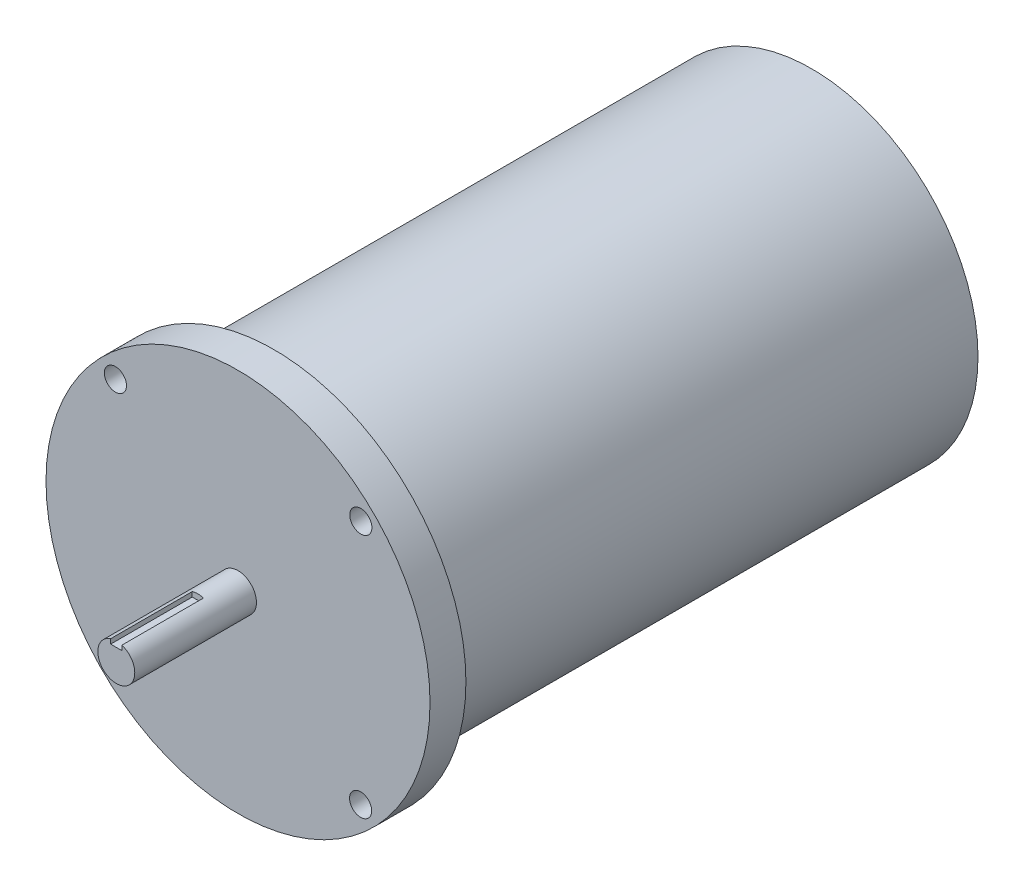
ISO-10303-21;
HEADER;
FILE_DESCRIPTION(('STEP AP214'),'2;1');
FILE_NAME('part.step','',(''),(''),'','','');
FILE_SCHEMA(('AUTOMOTIVE_DESIGN { 1 0 10303 214 1 1 1 1 }'));
ENDSEC;
DATA;
#1=APPLICATION_CONTEXT('core data for automotive mechanical design processes');
#2=APPLICATION_PROTOCOL_DEFINITION('international standard','automotive_design',2000,#1);
#3=PRODUCT_CONTEXT('',#1,'mechanical');
#4=PRODUCT('Part','Part','',(#3));
#5=PRODUCT_RELATED_PRODUCT_CATEGORY('part','',(#4));
#6=PRODUCT_DEFINITION_FORMATION('','',#4);
#7=PRODUCT_DEFINITION_CONTEXT('part definition',#1,'design');
#8=PRODUCT_DEFINITION('design','',#6,#7);
#9=PRODUCT_DEFINITION_SHAPE('','',#8);
#10=(LENGTH_UNIT() NAMED_UNIT(*) SI_UNIT(.MILLI.,.METRE.));
#11=(NAMED_UNIT(*) PLANE_ANGLE_UNIT() SI_UNIT($,.RADIAN.));
#12=(NAMED_UNIT(*) SI_UNIT($,.STERADIAN.) SOLID_ANGLE_UNIT());
#13=UNCERTAINTY_MEASURE_WITH_UNIT(LENGTH_MEASURE(1.E-05),#10,'distance_accuracy_value','');
#14=(GEOMETRIC_REPRESENTATION_CONTEXT(3) GLOBAL_UNCERTAINTY_ASSIGNED_CONTEXT((#13)) GLOBAL_UNIT_ASSIGNED_CONTEXT((#10,
#11,#12)) REPRESENTATION_CONTEXT('',''));
#15=CARTESIAN_POINT('',(0.,0.,0.));
#16=DIRECTION('',(0.,0.,1.));
#17=DIRECTION('',(1.,0.,0.));
#18=AXIS2_PLACEMENT_3D('',#15,#16,#17);
#19=CARTESIAN_POINT('',(0.,0.,231.199972222194));
#20=DIRECTION('',(0.,0.,1.));
#21=DIRECTION('',(1.,0.,0.));
#22=AXIS2_PLACEMENT_3D('',#19,#20,#21);
#23=PLANE('',#22);
#24=CARTESIAN_POINT('',(0.,0.,231.199972222194));
#25=DIRECTION('',(0.,0.,1.));
#26=DIRECTION('',(1.,0.,0.));
#27=AXIS2_PLACEMENT_3D('',#24,#25,#26);
#28=CIRCLE('',#27,71.501);
#29=CARTESIAN_POINT('',(-47.9570839676895,53.0331132248144,231.199972222194));
#30=VERTEX_POINT('',#29);
#31=CARTESIAN_POINT('',(-52.9513725196273,48.0473219783128,231.199972222194));
#32=VERTEX_POINT('',#31);
#33=EDGE_CURVE('E196',#30,#32,#28,.T.);
#34=ORIENTED_EDGE('',*,*,#33,.T.);
#35=CARTESIAN_POINT('',(-52.7140651842166,52.803905991926,231.199972222194));
#36=DIRECTION('',(0.,0.,1.));
#37=DIRECTION('',(1.,0.,0.));
#38=AXIS2_PLACEMENT_3D('',#35,#36,#37);
#39=CIRCLE('',#38,4.7625);
#40=EDGE_CURVE('E165',#32,#30,#39,.T.);
#41=ORIENTED_EDGE('',*,*,#40,.T.);
#42=EDGE_LOOP('',(#34,#41));
#43=FACE_BOUND('',#42,.T.);
#44=ADVANCED_FACE('F38',(#43),#23,.T.);
#45=CARTESIAN_POINT('',(53.0331132248144,47.9570839676896,231.199972222194));
#46=VERTEX_POINT('',#45);
#47=CARTESIAN_POINT('',(48.0473219783069,52.9513725196327,231.199972222194));
#48=VERTEX_POINT('',#47);
#49=EDGE_CURVE('E172',#46,#48,#28,.T.);
#50=ORIENTED_EDGE('',*,*,#49,.T.);
#51=CARTESIAN_POINT('',(52.803905991926,52.7140651842226,231.199972222194));
#52=DIRECTION('',(0.,0.,1.));
#53=DIRECTION('',(1.,0.,0.));
#54=AXIS2_PLACEMENT_3D('',#51,#52,#53);
#55=CIRCLE('',#54,4.76250000000591);
#56=EDGE_CURVE('E156',#48,#46,#55,.T.);
#57=ORIENTED_EDGE('',*,*,#56,.T.);
#58=EDGE_LOOP('',(#50,#57));
#59=FACE_BOUND('',#58,.T.);
#60=ADVANCED_FACE('F211',(#59),#23,.T.);
#61=CARTESIAN_POINT('',(47.9570839676879,-53.0331132248158,231.199972222194));
#62=VERTEX_POINT('',#61);
#63=CARTESIAN_POINT('',(52.9513725196396,-48.0473219782993,231.199972222194));
#64=VERTEX_POINT('',#63);
#65=EDGE_CURVE('E197',#62,#64,#28,.T.);
#66=ORIENTED_EDGE('',*,*,#65,.T.);
#67=CARTESIAN_POINT('',(52.7140651842226,-52.8039059919201,231.199972222194));
#68=DIRECTION('',(0.,0.,1.));
#69=DIRECTION('',(1.,0.,0.));
#70=AXIS2_PLACEMENT_3D('',#67,#68,#69);
#71=CIRCLE('',#70,4.76250000000791);
#72=EDGE_CURVE('E149',#64,#62,#71,.T.);
#73=ORIENTED_EDGE('',*,*,#72,.T.);
#74=EDGE_LOOP('',(#66,#73));
#75=FACE_BOUND('',#74,.T.);
#76=ADVANCED_FACE('F218',(#75),#23,.T.);
#77=CARTESIAN_POINT('',(-53.0331132248162,-47.9570839676874,231.199972222194));
#78=VERTEX_POINT('',#77);
#79=CARTESIAN_POINT('',(-48.0473219783048,-52.9513725196346,231.199972222194));
#80=VERTEX_POINT('',#79);
#81=EDGE_CURVE('E187',#78,#80,#28,.T.);
#82=ORIENTED_EDGE('',*,*,#81,.T.);
#83=CARTESIAN_POINT('',(-52.80390599192,-52.7140651842167,231.199972222194));
#84=DIRECTION('',(0.,0.,1.));
#85=DIRECTION('',(1.,0.,0.));
#86=AXIS2_PLACEMENT_3D('',#83,#84,#85);
#87=CIRCLE('',#86,4.76250000000245);
#88=EDGE_CURVE('E144',#80,#78,#87,.T.);
#89=ORIENTED_EDGE('',*,*,#88,.T.);
#90=EDGE_LOOP('',(#82,#89));
#91=FACE_BOUND('',#90,.T.);
#92=ADVANCED_FACE('F186',(#91),#23,.T.);
#93=CARTESIAN_POINT('',(0.,0.,231.199972222194));
#94=DIRECTION('',(0.,0.,-1.));
#95=DIRECTION('',(-1.,0.,0.));
#96=AXIS2_PLACEMENT_3D('',#93,#94,#95);
#97=CYLINDRICAL_SURFACE('',#96,71.501);
#98=ORIENTED_EDGE('',*,*,#49,.F.);
#99=EDGE_CURVE('E176',#64,#46,#28,.T.);
#100=ORIENTED_EDGE('',*,*,#99,.F.);
#101=ORIENTED_EDGE('',*,*,#65,.F.);
#102=EDGE_CURVE('E195',#80,#62,#28,.T.);
#103=ORIENTED_EDGE('',*,*,#102,.F.);
#104=ORIENTED_EDGE('',*,*,#81,.F.);
#105=EDGE_CURVE('E193',#32,#78,#28,.T.);
#106=ORIENTED_EDGE('',*,*,#105,.F.);
#107=ORIENTED_EDGE('',*,*,#33,.F.);
#108=EDGE_CURVE('E175',#48,#30,#28,.T.);
#109=ORIENTED_EDGE('',*,*,#108,.F.);
#110=EDGE_LOOP('',(#98,#100,#101,#103,#104,#106,#107,#109));
#111=FACE_BOUND('',#110,.T.);
#112=CARTESIAN_POINT('',(0.,0.,0.));
#113=DIRECTION('',(0.,0.,1.));
#114=DIRECTION('',(1.,0.,0.));
#115=AXIS2_PLACEMENT_3D('',#112,#113,#114);
#116=CIRCLE('',#115,71.501);
#117=CARTESIAN_POINT('',(71.501,0.,0.));
#118=VERTEX_POINT('',#117);
#119=EDGE_CURVE('E169',#118,#118,#116,.T.);
#120=ORIENTED_EDGE('',*,*,#119,.T.);
#121=EDGE_LOOP('',(#120));
#122=FACE_BOUND('',#121,.T.);
#123=ADVANCED_FACE('F40',(#111,#122),#97,.T.);
#124=CARTESIAN_POINT('',(0.,0.,0.));
#125=DIRECTION('',(0.,0.,1.));
#126=DIRECTION('',(1.,0.,0.));
#127=AXIS2_PLACEMENT_3D('',#124,#125,#126);
#128=PLANE('',#127);
#129=ORIENTED_EDGE('',*,*,#119,.F.);
#130=EDGE_LOOP('',(#129));
#131=FACE_BOUND('',#130,.T.);
#132=ADVANCED_FACE('F225',(#131),#128,.F.);
#133=CARTESIAN_POINT('',(0.,0.,231.199972222194));
#134=DIRECTION('',(0.,0.,1.));
#135=DIRECTION('',(1.,0.,0.));
#136=AXIS2_PLACEMENT_3D('',#133,#134,#135);
#137=PLANE('',#136);
#138=CARTESIAN_POINT('',(0.,0.,231.199972222194));
#139=DIRECTION('',(0.,0.,1.));
#140=DIRECTION('',(1.,0.,0.));
#141=AXIS2_PLACEMENT_3D('',#138,#139,#140);
#142=CIRCLE('',#141,82.55);
#143=CARTESIAN_POINT('',(82.55,0.,231.199972222194));
#144=VERTEX_POINT('',#143);
#145=EDGE_CURVE('E162',#144,#144,#142,.T.);
#146=ORIENTED_EDGE('',*,*,#145,.F.);
#147=EDGE_LOOP('',(#146));
#148=FACE_BOUND('',#147,.T.);
#149=EDGE_CURVE('E148',#46,#48,#55,.T.);
#150=ORIENTED_EDGE('',*,*,#149,.T.);
#151=ORIENTED_EDGE('',*,*,#108,.T.);
#152=EDGE_CURVE('E155',#30,#32,#39,.T.);
#153=ORIENTED_EDGE('',*,*,#152,.T.);
#154=ORIENTED_EDGE('',*,*,#105,.T.);
#155=EDGE_CURVE('E60',#78,#80,#87,.T.);
#156=ORIENTED_EDGE('',*,*,#155,.T.);
#157=ORIENTED_EDGE('',*,*,#102,.T.);
#158=EDGE_CURVE('E142',#62,#64,#71,.T.);
#159=ORIENTED_EDGE('',*,*,#158,.T.);
#160=ORIENTED_EDGE('',*,*,#99,.T.);
#161=EDGE_LOOP('',(#150,#151,#153,#154,#156,#157,#159,#160));
#162=FACE_BOUND('',#161,.T.);
#163=ADVANCED_FACE('F204',(#148,#162),#137,.F.);
#164=CARTESIAN_POINT('',(0.,0.,246.633999999972));
#165=DIRECTION('',(0.,0.,1.));
#166=DIRECTION('',(1.,0.,0.));
#167=AXIS2_PLACEMENT_3D('',#164,#165,#166);
#168=PLANE('',#167);
#169=CARTESIAN_POINT('',(0.,0.,246.633999999972));
#170=DIRECTION('',(0.,0.,1.));
#171=DIRECTION('',(1.,0.,0.));
#172=AXIS2_PLACEMENT_3D('',#169,#170,#171);
#173=CIRCLE('',#172,7.9375);
#174=CARTESIAN_POINT('',(7.9375,0.,246.633999999972));
#175=VERTEX_POINT('',#174);
#176=EDGE_CURVE('E133',#175,#175,#173,.T.);
#177=ORIENTED_EDGE('',*,*,#176,.F.);
#178=EDGE_LOOP('',(#177));
#179=FACE_BOUND('',#178,.T.);
#180=CARTESIAN_POINT('',(52.7140651842226,-52.8039059919201,246.633999999972));
#181=DIRECTION('',(0.,0.,1.));
#182=DIRECTION('',(1.,0.,0.));
#183=AXIS2_PLACEMENT_3D('',#180,#181,#182);
#184=CIRCLE('',#183,4.76250000000791);
#185=CARTESIAN_POINT('',(57.4765651842305,-52.8039059919201,246.633999999972));
#186=VERTEX_POINT('',#185);
#187=EDGE_CURVE('E145',#186,#186,#184,.T.);
#188=ORIENTED_EDGE('',*,*,#187,.F.);
#189=EDGE_LOOP('',(#188));
#190=FACE_BOUND('',#189,.T.);
#191=CARTESIAN_POINT('',(-52.7140651842166,52.803905991926,246.633999999972));
#192=DIRECTION('',(0.,0.,1.));
#193=DIRECTION('',(1.,0.,0.));
#194=AXIS2_PLACEMENT_3D('',#191,#192,#193);
#195=CIRCLE('',#194,4.7625);
#196=CARTESIAN_POINT('',(-47.9515651842166,52.803905991926,246.633999999972));
#197=VERTEX_POINT('',#196);
#198=EDGE_CURVE('E159',#197,#197,#195,.T.);
#199=ORIENTED_EDGE('',*,*,#198,.F.);
#200=EDGE_LOOP('',(#199));
#201=FACE_BOUND('',#200,.T.);
#202=CARTESIAN_POINT('',(0.,0.,246.633999999972));
#203=DIRECTION('',(0.,0.,1.));
#204=DIRECTION('',(1.,0.,0.));
#205=AXIS2_PLACEMENT_3D('',#202,#203,#204);
#206=CIRCLE('',#205,82.55);
#207=CARTESIAN_POINT('',(82.55,0.,246.633999999972));
#208=VERTEX_POINT('',#207);
#209=EDGE_CURVE('E166',#208,#208,#206,.T.);
#210=ORIENTED_EDGE('',*,*,#209,.T.);
#211=EDGE_LOOP('',(#210));
#212=FACE_BOUND('',#211,.T.);
#213=CARTESIAN_POINT('',(52.803905991926,52.7140651842226,246.633999999972));
#214=DIRECTION('',(0.,0.,1.));
#215=DIRECTION('',(1.,0.,0.));
#216=AXIS2_PLACEMENT_3D('',#213,#214,#215);
#217=CIRCLE('',#216,4.76250000000591);
#218=CARTESIAN_POINT('',(57.5664059919319,52.7140651842226,246.633999999972));
#219=VERTEX_POINT('',#218);
#220=EDGE_CURVE('E152',#219,#219,#217,.T.);
#221=ORIENTED_EDGE('',*,*,#220,.F.);
#222=EDGE_LOOP('',(#221));
#223=FACE_BOUND('',#222,.T.);
#224=CARTESIAN_POINT('',(-52.80390599192,-52.7140651842167,246.633999999972));
#225=DIRECTION('',(0.,0.,1.));
#226=DIRECTION('',(1.,0.,0.));
#227=AXIS2_PLACEMENT_3D('',#224,#225,#226);
#228=CIRCLE('',#227,4.76250000000245);
#229=CARTESIAN_POINT('',(-48.0414059919176,-52.7140651842167,246.633999999972));
#230=VERTEX_POINT('',#229);
#231=EDGE_CURVE('E139',#230,#230,#228,.T.);
#232=ORIENTED_EDGE('',*,*,#231,.F.);
#233=EDGE_LOOP('',(#232));
#234=FACE_BOUND('',#233,.T.);
#235=ADVANCED_FACE('F257',(#179,#190,#201,#212,#223,#234),#168,.T.);
#236=CARTESIAN_POINT('',(0.,0.,246.633999999972));
#237=DIRECTION('',(0.,0.,-1.));
#238=DIRECTION('',(-1.,0.,0.));
#239=AXIS2_PLACEMENT_3D('',#236,#237,#238);
#240=CYLINDRICAL_SURFACE('',#239,82.55);
#241=ORIENTED_EDGE('',*,*,#209,.F.);
#242=EDGE_LOOP('',(#241));
#243=FACE_BOUND('',#242,.T.);
#244=ORIENTED_EDGE('',*,*,#145,.T.);
#245=EDGE_LOOP('',(#244));
#246=FACE_BOUND('',#245,.T.);
#247=ADVANCED_FACE('F265',(#243,#246),#240,.T.);
#248=CARTESIAN_POINT('',(-52.7140651842166,52.803905991926,246.633999999972));
#249=DIRECTION('',(0.,0.,-1.));
#250=DIRECTION('',(-1.,0.,0.));
#251=AXIS2_PLACEMENT_3D('',#248,#249,#250);
#252=CYLINDRICAL_SURFACE('',#251,4.7625);
#253=ORIENTED_EDGE('',*,*,#198,.T.);
#254=EDGE_LOOP('',(#253));
#255=FACE_BOUND('',#254,.T.);
#256=ORIENTED_EDGE('',*,*,#152,.F.);
#257=ORIENTED_EDGE('',*,*,#40,.F.);
#258=EDGE_LOOP('',(#256,#257));
#259=FACE_BOUND('',#258,.T.);
#260=ADVANCED_FACE('F274',(#255,#259),#252,.F.);
#261=CARTESIAN_POINT('',(52.803905991926,52.7140651842226,246.633999999972));
#262=DIRECTION('',(0.,0.,-1.));
#263=DIRECTION('',(-1.,0.,0.));
#264=AXIS2_PLACEMENT_3D('',#261,#262,#263);
#265=CYLINDRICAL_SURFACE('',#264,4.76250000000591);
#266=ORIENTED_EDGE('',*,*,#220,.T.);
#267=EDGE_LOOP('',(#266));
#268=FACE_BOUND('',#267,.T.);
#269=ORIENTED_EDGE('',*,*,#56,.F.);
#270=ORIENTED_EDGE('',*,*,#149,.F.);
#271=EDGE_LOOP('',(#269,#270));
#272=FACE_BOUND('',#271,.T.);
#273=ADVANCED_FACE('F208',(#268,#272),#265,.F.);
#274=CARTESIAN_POINT('',(52.7140651842226,-52.8039059919201,246.633999999972));
#275=DIRECTION('',(0.,0.,-1.));
#276=DIRECTION('',(-1.,0.,0.));
#277=AXIS2_PLACEMENT_3D('',#274,#275,#276);
#278=CYLINDRICAL_SURFACE('',#277,4.76250000000791);
#279=ORIENTED_EDGE('',*,*,#187,.T.);
#280=EDGE_LOOP('',(#279));
#281=FACE_BOUND('',#280,.T.);
#282=ORIENTED_EDGE('',*,*,#72,.F.);
#283=ORIENTED_EDGE('',*,*,#158,.F.);
#284=EDGE_LOOP('',(#282,#283));
#285=FACE_BOUND('',#284,.T.);
#286=ADVANCED_FACE('F288',(#281,#285),#278,.F.);
#287=CARTESIAN_POINT('',(-52.80390599192,-52.7140651842167,246.633999999972));
#288=DIRECTION('',(0.,0.,-1.));
#289=DIRECTION('',(-1.,0.,0.));
#290=AXIS2_PLACEMENT_3D('',#287,#288,#289);
#291=CYLINDRICAL_SURFACE('',#290,4.76250000000245);
#292=ORIENTED_EDGE('',*,*,#231,.T.);
#293=EDGE_LOOP('',(#292));
#294=FACE_BOUND('',#293,.T.);
#295=ORIENTED_EDGE('',*,*,#155,.F.);
#296=ORIENTED_EDGE('',*,*,#88,.F.);
#297=EDGE_LOOP('',(#295,#296));
#298=FACE_BOUND('',#297,.T.);
#299=ADVANCED_FACE('F296',(#294,#298),#291,.F.);
#300=CARTESIAN_POINT('',(0.,0.,298.957999999972));
#301=DIRECTION('',(0.,0.,-1.));
#302=DIRECTION('',(-1.,0.,0.));
#303=AXIS2_PLACEMENT_3D('',#300,#301,#302);
#304=CYLINDRICAL_SURFACE('',#303,7.9375);
#305=CARTESIAN_POINT('',(0.,0.,263.905999999972));
#306=DIRECTION('',(0.,0.,1.));
#307=DIRECTION('',(1.,0.,0.));
#308=AXIS2_PLACEMENT_3D('',#305,#306,#307);
#309=CIRCLE('',#308,7.9375);
#310=CARTESIAN_POINT('',(2.413,7.56183425168788,263.905999999972));
#311=VERTEX_POINT('',#310);
#312=CARTESIAN_POINT('',(-2.413,7.56183425168788,263.905999999972));
#313=VERTEX_POINT('',#312);
#314=EDGE_CURVE('E11',#311,#313,#309,.T.);
#315=ORIENTED_EDGE('',*,*,#314,.F.);
#316=DIRECTION('',(0.,0.,-1.));
#317=VECTOR('',#316,1.);
#318=CARTESIAN_POINT('',(2.413,7.56183425168788,298.957999999972));
#319=LINE('',#318,#317);
#320=CARTESIAN_POINT('',(2.413,7.56183425168788,298.957999999972));
#321=VERTEX_POINT('',#320);
#322=EDGE_CURVE('E130',#311,#321,#319,.F.);
#323=ORIENTED_EDGE('',*,*,#322,.T.);
#324=CARTESIAN_POINT('',(0.,0.,298.957999999972));
#325=DIRECTION('',(0.,0.,1.));
#326=DIRECTION('',(1.,0.,0.));
#327=AXIS2_PLACEMENT_3D('',#324,#325,#326);
#328=CIRCLE('',#327,7.9375);
#329=CARTESIAN_POINT('',(-2.413,7.56183425168788,298.957999999972));
#330=VERTEX_POINT('',#329);
#331=EDGE_CURVE('E134',#330,#321,#328,.T.);
#332=ORIENTED_EDGE('',*,*,#331,.F.);
#333=DIRECTION('',(0.,0.,-1.));
#334=VECTOR('',#333,1.);
#335=CARTESIAN_POINT('',(-2.413,7.56183425168788,298.957999999972));
#336=LINE('',#335,#334);
#337=EDGE_CURVE('E53',#330,#313,#336,.T.);
#338=ORIENTED_EDGE('',*,*,#337,.T.);
#339=EDGE_LOOP('',(#315,#323,#332,#338));
#340=FACE_BOUND('',#339,.T.);
#341=ORIENTED_EDGE('',*,*,#176,.T.);
#342=EDGE_LOOP('',(#341));
#343=FACE_BOUND('',#342,.T.);
#344=ADVANCED_FACE('F303',(#340,#343),#304,.T.);
#345=CARTESIAN_POINT('',(0.,0.,298.957999999972));
#346=DIRECTION('',(0.,0.,1.));
#347=DIRECTION('',(1.,0.,0.));
#348=AXIS2_PLACEMENT_3D('',#345,#346,#347);
#349=PLANE('',#348);
#350=DIRECTION('',(0.,1.,0.));
#351=VECTOR('',#350,1.);
#352=CARTESIAN_POINT('',(2.413,10.3505,298.957999999972));
#353=LINE('',#352,#351);
#354=CARTESIAN_POINT('',(2.413,5.5245,298.957999999972));
#355=VERTEX_POINT('',#354);
#356=EDGE_CURVE('E124',#355,#321,#353,.T.);
#357=ORIENTED_EDGE('',*,*,#356,.F.);
#358=DIRECTION('',(1.,0.,0.));
#359=VECTOR('',#358,1.);
#360=CARTESIAN_POINT('',(-2.413,5.5245,298.957999999972));
#361=LINE('',#360,#359);
#362=CARTESIAN_POINT('',(-2.413,5.5245,298.957999999972));
#363=VERTEX_POINT('',#362);
#364=EDGE_CURVE('E126',#363,#355,#361,.T.);
#365=ORIENTED_EDGE('',*,*,#364,.F.);
#366=DIRECTION('',(0.,-1.,0.));
#367=VECTOR('',#366,1.);
#368=CARTESIAN_POINT('',(-2.413,0.,298.957999999972));
#369=LINE('',#368,#367);
#370=EDGE_CURVE('E46',#330,#363,#369,.T.);
#371=ORIENTED_EDGE('',*,*,#370,.F.);
#372=ORIENTED_EDGE('',*,*,#331,.T.);
#373=EDGE_LOOP('',(#357,#365,#371,#372));
#374=FACE_BOUND('',#373,.T.);
#375=ADVANCED_FACE('F310',(#374),#349,.T.);
#376=CARTESIAN_POINT('',(0.,0.,263.905999999972));
#377=DIRECTION('',(0.,0.,1.));
#378=DIRECTION('',(1.,0.,0.));
#379=AXIS2_PLACEMENT_3D('',#376,#377,#378);
#380=PLANE('',#379);
#381=ORIENTED_EDGE('',*,*,#314,.T.);
#382=DIRECTION('',(0.,-1.,0.));
#383=VECTOR('',#382,1.);
#384=CARTESIAN_POINT('',(-2.413,10.3505,263.905999999972));
#385=LINE('',#384,#383);
#386=CARTESIAN_POINT('',(-2.413,5.5245,263.905999999972));
#387=VERTEX_POINT('',#386);
#388=EDGE_CURVE('E102',#313,#387,#385,.T.);
#389=ORIENTED_EDGE('',*,*,#388,.T.);
#390=DIRECTION('',(1.,0.,0.));
#391=VECTOR('',#390,1.);
#392=CARTESIAN_POINT('',(-2.413,5.5245,263.905999999972));
#393=LINE('',#392,#391);
#394=CARTESIAN_POINT('',(2.413,5.5245,263.905999999972));
#395=VERTEX_POINT('',#394);
#396=EDGE_CURVE('E107',#387,#395,#393,.T.);
#397=ORIENTED_EDGE('',*,*,#396,.T.);
#398=DIRECTION('',(0.,1.,0.));
#399=VECTOR('',#398,1.);
#400=CARTESIAN_POINT('',(2.413,10.3505,263.905999999972));
#401=LINE('',#400,#399);
#402=EDGE_CURVE('E109',#395,#311,#401,.T.);
#403=ORIENTED_EDGE('',*,*,#402,.T.);
#404=EDGE_LOOP('',(#381,#389,#397,#403));
#405=FACE_BOUND('',#404,.T.);
#406=ADVANCED_FACE('F104',(#405),#380,.T.);
#407=CARTESIAN_POINT('',(2.413,10.3505,263.905999999972));
#408=DIRECTION('',(1.,0.,0.));
#409=DIRECTION('',(0.,1.,0.));
#410=AXIS2_PLACEMENT_3D('',#407,#408,#409);
#411=PLANE('',#410);
#412=ORIENTED_EDGE('',*,*,#402,.F.);
#413=DIRECTION('',(0.,0.,1.));
#414=VECTOR('',#413,1.);
#415=CARTESIAN_POINT('',(2.413,5.5245,263.905999999972));
#416=LINE('',#415,#414);
#417=EDGE_CURVE('E117',#395,#355,#416,.T.);
#418=ORIENTED_EDGE('',*,*,#417,.T.);
#419=ORIENTED_EDGE('',*,*,#356,.T.);
#420=ORIENTED_EDGE('',*,*,#322,.F.);
#421=EDGE_LOOP('',(#412,#418,#419,#420));
#422=FACE_BOUND('',#421,.T.);
#423=ADVANCED_FACE('F325',(#422),#411,.F.);
#424=CARTESIAN_POINT('',(-2.413,10.3505,263.905999999972));
#425=DIRECTION('',(-1.,0.,0.));
#426=DIRECTION('',(0.,-1.,0.));
#427=AXIS2_PLACEMENT_3D('',#424,#425,#426);
#428=PLANE('',#427);
#429=ORIENTED_EDGE('',*,*,#370,.T.);
#430=DIRECTION('',(0.,0.,1.));
#431=VECTOR('',#430,1.);
#432=CARTESIAN_POINT('',(-2.413,5.5245,263.905999999972));
#433=LINE('',#432,#431);
#434=EDGE_CURVE('E112',#387,#363,#433,.T.);
#435=ORIENTED_EDGE('',*,*,#434,.F.);
#436=ORIENTED_EDGE('',*,*,#388,.F.);
#437=ORIENTED_EDGE('',*,*,#337,.F.);
#438=EDGE_LOOP('',(#429,#435,#436,#437));
#439=FACE_BOUND('',#438,.T.);
#440=ADVANCED_FACE('F113',(#439),#428,.F.);
#441=CARTESIAN_POINT('',(-2.413,5.5245,263.905999999972));
#442=DIRECTION('',(0.,-1.,0.));
#443=DIRECTION('',(0.,0.,-1.));
#444=AXIS2_PLACEMENT_3D('',#441,#442,#443);
#445=PLANE('',#444);
#446=ORIENTED_EDGE('',*,*,#364,.T.);
#447=ORIENTED_EDGE('',*,*,#417,.F.);
#448=ORIENTED_EDGE('',*,*,#396,.F.);
#449=ORIENTED_EDGE('',*,*,#434,.T.);
#450=EDGE_LOOP('',(#446,#447,#448,#449));
#451=FACE_BOUND('',#450,.T.);
#452=ADVANCED_FACE('F119',(#451),#445,.F.);
#453=CLOSED_SHELL('',(#44,#60,#76,#92,#123,#132,#163,#235,#247,#260,#273,#286,#299,#344,#375,
#406,#423,#440,#452));
#454=MANIFOLD_SOLID_BREP('B2',#453);
#455=ADVANCED_BREP_SHAPE_REPRESENTATION('',(#18,#454),#14);
#456=SHAPE_DEFINITION_REPRESENTATION(#9,#455);
ENDSEC;
END-ISO-10303-21;
